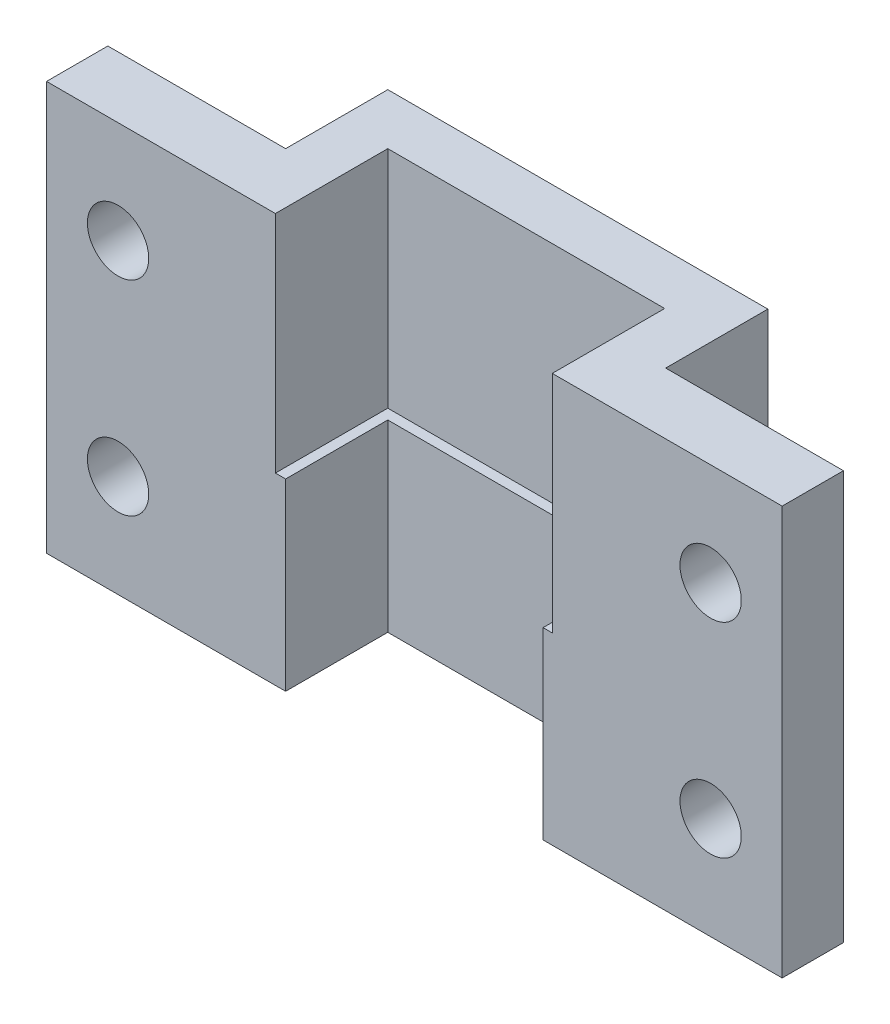
ISO-10303-21;
HEADER;
FILE_DESCRIPTION(('STEP AP214'),'2;1');
FILE_NAME('part.step','',(''),(''),'','','');
FILE_SCHEMA(('AUTOMOTIVE_DESIGN { 1 0 10303 214 1 1 1 1 }'));
ENDSEC;
DATA;
#1=APPLICATION_CONTEXT('core data for automotive mechanical design processes');
#2=APPLICATION_PROTOCOL_DEFINITION('international standard','automotive_design',2000,#1);
#3=PRODUCT_CONTEXT('',#1,'mechanical');
#4=PRODUCT('Part','Part','',(#3));
#5=PRODUCT_RELATED_PRODUCT_CATEGORY('part','',(#4));
#6=PRODUCT_DEFINITION_FORMATION('','',#4);
#7=PRODUCT_DEFINITION_CONTEXT('part definition',#1,'design');
#8=PRODUCT_DEFINITION('design','',#6,#7);
#9=PRODUCT_DEFINITION_SHAPE('','',#8);
#10=(LENGTH_UNIT() NAMED_UNIT(*) SI_UNIT(.MILLI.,.METRE.));
#11=(NAMED_UNIT(*) PLANE_ANGLE_UNIT() SI_UNIT($,.RADIAN.));
#12=(NAMED_UNIT(*) SI_UNIT($,.STERADIAN.) SOLID_ANGLE_UNIT());
#13=UNCERTAINTY_MEASURE_WITH_UNIT(LENGTH_MEASURE(1.E-05),#10,'distance_accuracy_value','');
#14=(GEOMETRIC_REPRESENTATION_CONTEXT(3) GLOBAL_UNCERTAINTY_ASSIGNED_CONTEXT((#13)) GLOBAL_UNIT_ASSIGNED_CONTEXT((#10,
#11,#12)) REPRESENTATION_CONTEXT('',''));
#15=CARTESIAN_POINT('',(0.,0.,0.));
#16=DIRECTION('',(0.,0.,1.));
#17=DIRECTION('',(1.,0.,0.));
#18=AXIS2_PLACEMENT_3D('',#15,#16,#17);
#19=CARTESIAN_POINT('',(28.4704225352113,20.,0.));
#20=DIRECTION('',(-1.,0.,0.));
#21=DIRECTION('',(0.,0.,1.));
#22=AXIS2_PLACEMENT_3D('',#19,#20,#21);
#23=PLANE('',#22);
#24=DIRECTION('',(0.,0.,-1.));
#25=VECTOR('',#24,1.);
#26=CARTESIAN_POINT('',(28.4704225352113,0.,0.));
#27=LINE('',#26,#25);
#28=CARTESIAN_POINT('',(28.4704225352113,0.,3.));
#29=VERTEX_POINT('',#28);
#30=CARTESIAN_POINT('',(28.4704225352113,0.,0.));
#31=VERTEX_POINT('',#30);
#32=EDGE_CURVE('E161',#29,#31,#27,.T.);
#33=ORIENTED_EDGE('',*,*,#32,.T.);
#34=DIRECTION('',(0.,-1.,0.));
#35=VECTOR('',#34,1.);
#36=CARTESIAN_POINT('',(28.4704225352113,20.,0.));
#37=LINE('',#36,#35);
#38=CARTESIAN_POINT('',(28.4704225352113,20.,0.));
#39=VERTEX_POINT('',#38);
#40=EDGE_CURVE('E11',#39,#31,#37,.T.);
#41=ORIENTED_EDGE('',*,*,#40,.F.);
#42=DIRECTION('',(0.,0.,-1.));
#43=VECTOR('',#42,1.);
#44=CARTESIAN_POINT('',(28.4704225352113,20.,0.));
#45=LINE('',#44,#43);
#46=CARTESIAN_POINT('',(28.4704225352113,20.,3.));
#47=VERTEX_POINT('',#46);
#48=EDGE_CURVE('E188',#47,#39,#45,.T.);
#49=ORIENTED_EDGE('',*,*,#48,.F.);
#50=DIRECTION('',(0.,-1.,0.));
#51=VECTOR('',#50,1.);
#52=CARTESIAN_POINT('',(28.4704225352113,20.,3.));
#53=LINE('',#52,#51);
#54=EDGE_CURVE('E160',#47,#29,#53,.T.);
#55=ORIENTED_EDGE('',*,*,#54,.T.);
#56=EDGE_LOOP('',(#33,#41,#49,#55));
#57=FACE_BOUND('',#56,.T.);
#58=ADVANCED_FACE('F34',(#57),#23,.F.);
#59=CARTESIAN_POINT('',(19.7704225352113,20.,0.));
#60=DIRECTION('',(0.,0.,1.));
#61=DIRECTION('',(1.,0.,0.));
#62=AXIS2_PLACEMENT_3D('',#59,#60,#61);
#63=PLANE('',#62);
#64=CARTESIAN_POINT('',(24.9704225352113,15.,0.));
#65=DIRECTION('',(0.,0.,-1.));
#66=DIRECTION('',(-1.,0.,0.));
#67=AXIS2_PLACEMENT_3D('',#64,#65,#66);
#68=CIRCLE('',#67,1.5);
#69=CARTESIAN_POINT('',(23.4704225352113,15.,0.));
#70=VERTEX_POINT('',#69);
#71=EDGE_CURVE('E272',#70,#70,#68,.T.);
#72=ORIENTED_EDGE('',*,*,#71,.F.);
#73=EDGE_LOOP('',(#72));
#74=FACE_BOUND('',#73,.T.);
#75=CARTESIAN_POINT('',(24.9704225352113,5.,0.));
#76=DIRECTION('',(0.,0.,-1.));
#77=DIRECTION('',(-1.,0.,0.));
#78=AXIS2_PLACEMENT_3D('',#75,#76,#77);
#79=CIRCLE('',#78,1.5);
#80=CARTESIAN_POINT('',(23.4704225352113,5.,0.));
#81=VERTEX_POINT('',#80);
#82=EDGE_CURVE('E275',#81,#81,#79,.T.);
#83=ORIENTED_EDGE('',*,*,#82,.F.);
#84=EDGE_LOOP('',(#83));
#85=FACE_BOUND('',#84,.T.);
#86=DIRECTION('',(-1.,0.,0.));
#87=VECTOR('',#86,1.);
#88=CARTESIAN_POINT('',(19.7704225352113,0.,0.));
#89=LINE('',#88,#87);
#90=CARTESIAN_POINT('',(19.7704225352113,0.,0.));
#91=VERTEX_POINT('',#90);
#92=EDGE_CURVE('E164',#31,#91,#89,.T.);
#93=ORIENTED_EDGE('',*,*,#92,.T.);
#94=DIRECTION('',(0.,-1.,0.));
#95=VECTOR('',#94,1.);
#96=CARTESIAN_POINT('',(19.7704225352113,20.,0.));
#97=LINE('',#96,#95);
#98=CARTESIAN_POINT('',(19.7704225352113,20.,0.));
#99=VERTEX_POINT('',#98);
#100=EDGE_CURVE('E42',#99,#91,#97,.T.);
#101=ORIENTED_EDGE('',*,*,#100,.F.);
#102=DIRECTION('',(-1.,0.,0.));
#103=VECTOR('',#102,1.);
#104=CARTESIAN_POINT('',(19.7704225352113,20.,0.));
#105=LINE('',#104,#103);
#106=EDGE_CURVE('E111',#39,#99,#105,.T.);
#107=ORIENTED_EDGE('',*,*,#106,.F.);
#108=ORIENTED_EDGE('',*,*,#40,.T.);
#109=EDGE_LOOP('',(#93,#101,#107,#108));
#110=FACE_BOUND('',#109,.T.);
#111=ADVANCED_FACE('F243',(#74,#85,#110),#63,.F.);
#112=CARTESIAN_POINT('',(19.7704225352113,20.,-5.));
#113=DIRECTION('',(-1.,0.,0.));
#114=DIRECTION('',(0.,0.,1.));
#115=AXIS2_PLACEMENT_3D('',#112,#113,#114);
#116=PLANE('',#115);
#117=DIRECTION('',(0.,0.,-1.));
#118=VECTOR('',#117,1.);
#119=CARTESIAN_POINT('',(19.7704225352113,0.,-5.));
#120=LINE('',#119,#118);
#121=CARTESIAN_POINT('',(19.7704225352113,0.,-5.));
#122=VERTEX_POINT('',#121);
#123=EDGE_CURVE('E166',#91,#122,#120,.T.);
#124=ORIENTED_EDGE('',*,*,#123,.T.);
#125=DIRECTION('',(0.,-1.,0.));
#126=VECTOR('',#125,1.);
#127=CARTESIAN_POINT('',(19.7704225352113,20.,-5.));
#128=LINE('',#127,#126);
#129=CARTESIAN_POINT('',(19.7704225352113,20.,-5.));
#130=VERTEX_POINT('',#129);
#131=EDGE_CURVE('E203',#130,#122,#128,.T.);
#132=ORIENTED_EDGE('',*,*,#131,.F.);
#133=DIRECTION('',(0.,0.,-1.));
#134=VECTOR('',#133,1.);
#135=CARTESIAN_POINT('',(19.7704225352113,20.,-5.));
#136=LINE('',#135,#134);
#137=EDGE_CURVE('E261',#99,#130,#136,.T.);
#138=ORIENTED_EDGE('',*,*,#137,.F.);
#139=ORIENTED_EDGE('',*,*,#100,.T.);
#140=EDGE_LOOP('',(#124,#132,#138,#139));
#141=FACE_BOUND('',#140,.T.);
#142=ADVANCED_FACE('F248',(#141),#116,.F.);
#143=CARTESIAN_POINT('',(1.17042253521126,20.,-5.));
#144=DIRECTION('',(0.,0.,1.));
#145=DIRECTION('',(1.,0.,0.));
#146=AXIS2_PLACEMENT_3D('',#143,#144,#145);
#147=PLANE('',#146);
#148=DIRECTION('',(-1.,0.,0.));
#149=VECTOR('',#148,1.);
#150=CARTESIAN_POINT('',(1.17042253521126,0.,-5.));
#151=LINE('',#150,#149);
#152=CARTESIAN_POINT('',(1.17042253521126,0.,-5.));
#153=VERTEX_POINT('',#152);
#154=EDGE_CURVE('E168',#122,#153,#151,.T.);
#155=ORIENTED_EDGE('',*,*,#154,.T.);
#156=DIRECTION('',(0.,-1.,0.));
#157=VECTOR('',#156,1.);
#158=CARTESIAN_POINT('',(1.17042253521126,20.,-5.));
#159=LINE('',#158,#157);
#160=CARTESIAN_POINT('',(1.17042253521126,20.,-5.));
#161=VERTEX_POINT('',#160);
#162=EDGE_CURVE('E200',#161,#153,#159,.T.);
#163=ORIENTED_EDGE('',*,*,#162,.F.);
#164=DIRECTION('',(-1.,0.,0.));
#165=VECTOR('',#164,1.);
#166=CARTESIAN_POINT('',(1.17042253521126,20.,-5.));
#167=LINE('',#166,#165);
#168=EDGE_CURVE('E263',#130,#161,#167,.T.);
#169=ORIENTED_EDGE('',*,*,#168,.F.);
#170=ORIENTED_EDGE('',*,*,#131,.T.);
#171=EDGE_LOOP('',(#155,#163,#169,#170));
#172=FACE_BOUND('',#171,.T.);
#173=ADVANCED_FACE('F502',(#172),#147,.F.);
#174=CARTESIAN_POINT('',(1.17042253521126,20.,-5.));
#175=DIRECTION('',(1.,0.,0.));
#176=DIRECTION('',(0.,0.,-1.));
#177=AXIS2_PLACEMENT_3D('',#174,#175,#176);
#178=PLANE('',#177);
#179=DIRECTION('',(0.,0.,1.));
#180=VECTOR('',#179,1.);
#181=CARTESIAN_POINT('',(1.17042253521126,0.,-5.));
#182=LINE('',#181,#180);
#183=CARTESIAN_POINT('',(1.17042253521126,0.,0.));
#184=VERTEX_POINT('',#183);
#185=EDGE_CURVE('E170',#153,#184,#182,.T.);
#186=ORIENTED_EDGE('',*,*,#185,.T.);
#187=DIRECTION('',(0.,-1.,0.));
#188=VECTOR('',#187,1.);
#189=CARTESIAN_POINT('',(1.17042253521126,20.,0.));
#190=LINE('',#189,#188);
#191=CARTESIAN_POINT('',(1.17042253521126,20.,0.));
#192=VERTEX_POINT('',#191);
#193=EDGE_CURVE('E148',#192,#184,#190,.T.);
#194=ORIENTED_EDGE('',*,*,#193,.F.);
#195=DIRECTION('',(0.,0.,1.));
#196=VECTOR('',#195,1.);
#197=CARTESIAN_POINT('',(1.17042253521126,20.,-5.));
#198=LINE('',#197,#196);
#199=EDGE_CURVE('E136',#161,#192,#198,.T.);
#200=ORIENTED_EDGE('',*,*,#199,.F.);
#201=ORIENTED_EDGE('',*,*,#162,.T.);
#202=EDGE_LOOP('',(#186,#194,#200,#201));
#203=FACE_BOUND('',#202,.T.);
#204=ADVANCED_FACE('F471',(#203),#178,.F.);
#205=CARTESIAN_POINT('',(1.17042253521126,20.,0.));
#206=DIRECTION('',(0.,0.,1.));
#207=DIRECTION('',(1.,0.,0.));
#208=AXIS2_PLACEMENT_3D('',#205,#206,#207);
#209=PLANE('',#208);
#210=CARTESIAN_POINT('',(-4.02957746478874,5.,0.));
#211=DIRECTION('',(0.,0.,-1.));
#212=DIRECTION('',(-1.,0.,0.));
#213=AXIS2_PLACEMENT_3D('',#210,#211,#212);
#214=CIRCLE('',#213,1.5);
#215=CARTESIAN_POINT('',(-5.52957746478874,5.,0.));
#216=VERTEX_POINT('',#215);
#217=EDGE_CURVE('E271',#216,#216,#214,.T.);
#218=ORIENTED_EDGE('',*,*,#217,.F.);
#219=EDGE_LOOP('',(#218));
#220=FACE_BOUND('',#219,.T.);
#221=CARTESIAN_POINT('',(-4.02957746478874,15.,0.));
#222=DIRECTION('',(0.,0.,-1.));
#223=DIRECTION('',(-1.,0.,0.));
#224=AXIS2_PLACEMENT_3D('',#221,#222,#223);
#225=CIRCLE('',#224,1.5);
#226=CARTESIAN_POINT('',(-5.52957746478874,15.,0.));
#227=VERTEX_POINT('',#226);
#228=EDGE_CURVE('E212',#227,#227,#225,.T.);
#229=ORIENTED_EDGE('',*,*,#228,.F.);
#230=EDGE_LOOP('',(#229));
#231=FACE_BOUND('',#230,.T.);
#232=DIRECTION('',(-1.,0.,0.));
#233=VECTOR('',#232,1.);
#234=CARTESIAN_POINT('',(1.17042253521126,0.,0.));
#235=LINE('',#234,#233);
#236=CARTESIAN_POINT('',(-7.52957746478874,0.,0.));
#237=VERTEX_POINT('',#236);
#238=EDGE_CURVE('E145',#184,#237,#235,.T.);
#239=ORIENTED_EDGE('',*,*,#238,.T.);
#240=DIRECTION('',(0.,-1.,0.));
#241=VECTOR('',#240,1.);
#242=CARTESIAN_POINT('',(-7.52957746478874,20.,0.));
#243=LINE('',#242,#241);
#244=CARTESIAN_POINT('',(-7.52957746478874,20.,0.));
#245=VERTEX_POINT('',#244);
#246=EDGE_CURVE('E142',#245,#237,#243,.T.);
#247=ORIENTED_EDGE('',*,*,#246,.F.);
#248=DIRECTION('',(-1.,0.,0.));
#249=VECTOR('',#248,1.);
#250=CARTESIAN_POINT('',(1.17042253521126,20.,0.));
#251=LINE('',#250,#249);
#252=EDGE_CURVE('E127',#192,#245,#251,.T.);
#253=ORIENTED_EDGE('',*,*,#252,.F.);
#254=ORIENTED_EDGE('',*,*,#193,.T.);
#255=EDGE_LOOP('',(#239,#247,#253,#254));
#256=FACE_BOUND('',#255,.T.);
#257=ADVANCED_FACE('F143',(#220,#231,#256),#209,.F.);
#258=CARTESIAN_POINT('',(-7.52957746478874,20.,0.));
#259=DIRECTION('',(1.,0.,0.));
#260=DIRECTION('',(0.,0.,-1.));
#261=AXIS2_PLACEMENT_3D('',#258,#259,#260);
#262=PLANE('',#261);
#263=DIRECTION('',(0.,0.,1.));
#264=VECTOR('',#263,1.);
#265=CARTESIAN_POINT('',(-7.52957746478874,0.,0.));
#266=LINE('',#265,#264);
#267=CARTESIAN_POINT('',(-7.52957746478874,0.,3.));
#268=VERTEX_POINT('',#267);
#269=EDGE_CURVE('E173',#237,#268,#266,.T.);
#270=ORIENTED_EDGE('',*,*,#269,.T.);
#271=DIRECTION('',(0.,-1.,0.));
#272=VECTOR('',#271,1.);
#273=CARTESIAN_POINT('',(-7.52957746478874,20.,3.));
#274=LINE('',#273,#272);
#275=CARTESIAN_POINT('',(-7.52957746478874,20.,3.));
#276=VERTEX_POINT('',#275);
#277=EDGE_CURVE('E149',#276,#268,#274,.T.);
#278=ORIENTED_EDGE('',*,*,#277,.F.);
#279=DIRECTION('',(0.,0.,1.));
#280=VECTOR('',#279,1.);
#281=CARTESIAN_POINT('',(-7.52957746478874,20.,0.));
#282=LINE('',#281,#280);
#283=EDGE_CURVE('E133',#245,#276,#282,.T.);
#284=ORIENTED_EDGE('',*,*,#283,.F.);
#285=ORIENTED_EDGE('',*,*,#246,.T.);
#286=EDGE_LOOP('',(#270,#278,#284,#285));
#287=FACE_BOUND('',#286,.T.);
#288=ADVANCED_FACE('F151',(#287),#262,.F.);
#289=CARTESIAN_POINT('',(-7.52957746478874,20.,3.));
#290=DIRECTION('',(0.,0.,-1.));
#291=DIRECTION('',(-1.,0.,0.));
#292=AXIS2_PLACEMENT_3D('',#289,#290,#291);
#293=PLANE('',#292);
#294=CARTESIAN_POINT('',(-4.02957746478874,5.,3.));
#295=DIRECTION('',(0.,0.,-1.));
#296=DIRECTION('',(-1.,0.,0.));
#297=AXIS2_PLACEMENT_3D('',#294,#295,#296);
#298=CIRCLE('',#297,1.5);
#299=CARTESIAN_POINT('',(-5.52957746478874,5.,3.));
#300=VERTEX_POINT('',#299);
#301=EDGE_CURVE('E37',#300,#300,#298,.T.);
#302=ORIENTED_EDGE('',*,*,#301,.T.);
#303=EDGE_LOOP('',(#302));
#304=FACE_BOUND('',#303,.T.);
#305=CARTESIAN_POINT('',(-4.02957746478874,15.,3.));
#306=DIRECTION('',(0.,0.,-1.));
#307=DIRECTION('',(-1.,0.,0.));
#308=AXIS2_PLACEMENT_3D('',#305,#306,#307);
#309=CIRCLE('',#308,1.5);
#310=CARTESIAN_POINT('',(-5.52957746478874,15.,3.));
#311=VERTEX_POINT('',#310);
#312=EDGE_CURVE('E214',#311,#311,#309,.T.);
#313=ORIENTED_EDGE('',*,*,#312,.T.);
#314=EDGE_LOOP('',(#313));
#315=FACE_BOUND('',#314,.T.);
#316=DIRECTION('',(1.,0.,0.));
#317=VECTOR('',#316,1.);
#318=CARTESIAN_POINT('',(4.17042253521126,9.,3.));
#319=LINE('',#318,#317);
#320=CARTESIAN_POINT('',(3.67042253521126,9.,3.));
#321=VERTEX_POINT('',#320);
#322=CARTESIAN_POINT('',(4.17042253521126,9.,3.));
#323=VERTEX_POINT('',#322);
#324=EDGE_CURVE('E293',#321,#323,#319,.T.);
#325=ORIENTED_EDGE('',*,*,#324,.F.);
#326=DIRECTION('',(0.,1.,0.));
#327=VECTOR('',#326,1.);
#328=CARTESIAN_POINT('',(3.67042253521126,9.,3.));
#329=LINE('',#328,#327);
#330=CARTESIAN_POINT('',(3.67042253521126,20.,3.));
#331=VERTEX_POINT('',#330);
#332=EDGE_CURVE('E276',#321,#331,#329,.T.);
#333=ORIENTED_EDGE('',*,*,#332,.T.);
#334=DIRECTION('',(1.,0.,0.));
#335=VECTOR('',#334,1.);
#336=CARTESIAN_POINT('',(-7.52957746478874,20.,3.));
#337=LINE('',#336,#335);
#338=EDGE_CURVE('E154',#276,#331,#337,.T.);
#339=ORIENTED_EDGE('',*,*,#338,.F.);
#340=ORIENTED_EDGE('',*,*,#277,.T.);
#341=DIRECTION('',(1.,0.,0.));
#342=VECTOR('',#341,1.);
#343=CARTESIAN_POINT('',(-7.52957746478874,0.,3.));
#344=LINE('',#343,#342);
#345=CARTESIAN_POINT('',(4.17042253521126,0.,3.));
#346=VERTEX_POINT('',#345);
#347=EDGE_CURVE('E175',#268,#346,#344,.T.);
#348=ORIENTED_EDGE('',*,*,#347,.T.);
#349=DIRECTION('',(0.,-1.,0.));
#350=VECTOR('',#349,1.);
#351=CARTESIAN_POINT('',(4.17042253521126,20.,3.));
#352=LINE('',#351,#350);
#353=EDGE_CURVE('E196',#323,#346,#352,.T.);
#354=ORIENTED_EDGE('',*,*,#353,.F.);
#355=EDGE_LOOP('',(#325,#333,#339,#340,#348,#354));
#356=FACE_BOUND('',#355,.T.);
#357=ADVANCED_FACE('F221',(#304,#315,#356),#293,.F.);
#358=CARTESIAN_POINT('',(4.17042253521126,20.,3.));
#359=DIRECTION('',(-1.,0.,0.));
#360=DIRECTION('',(0.,0.,1.));
#361=AXIS2_PLACEMENT_3D('',#358,#359,#360);
#362=PLANE('',#361);
#363=DIRECTION('',(0.,-1.,0.));
#364=VECTOR('',#363,1.);
#365=CARTESIAN_POINT('',(4.17042253521126,20.,-2.));
#366=LINE('',#365,#364);
#367=CARTESIAN_POINT('',(4.17042253521126,9.,-2.));
#368=VERTEX_POINT('',#367);
#369=CARTESIAN_POINT('',(4.17042253521126,0.,-2.));
#370=VERTEX_POINT('',#369);
#371=EDGE_CURVE('E194',#368,#370,#366,.T.);
#372=ORIENTED_EDGE('',*,*,#371,.F.);
#373=DIRECTION('',(0.,0.,-1.));
#374=VECTOR('',#373,1.);
#375=CARTESIAN_POINT('',(4.17042253521126,9.,3.));
#376=LINE('',#375,#374);
#377=EDGE_CURVE('E316',#323,#368,#376,.T.);
#378=ORIENTED_EDGE('',*,*,#377,.F.);
#379=ORIENTED_EDGE('',*,*,#353,.T.);
#380=DIRECTION('',(0.,0.,-1.));
#381=VECTOR('',#380,1.);
#382=CARTESIAN_POINT('',(4.17042253521126,0.,3.));
#383=LINE('',#382,#381);
#384=EDGE_CURVE('E178',#346,#370,#383,.T.);
#385=ORIENTED_EDGE('',*,*,#384,.T.);
#386=EDGE_LOOP('',(#372,#378,#379,#385));
#387=FACE_BOUND('',#386,.T.);
#388=ADVANCED_FACE('F333',(#387),#362,.F.);
#389=CARTESIAN_POINT('',(4.17042253521126,20.,-2.));
#390=DIRECTION('',(0.,0.,-1.));
#391=DIRECTION('',(-1.,0.,0.));
#392=AXIS2_PLACEMENT_3D('',#389,#390,#391);
#393=PLANE('',#392);
#394=DIRECTION('',(0.,-1.,0.));
#395=VECTOR('',#394,1.);
#396=CARTESIAN_POINT('',(16.7704225352113,20.,-2.));
#397=LINE('',#396,#395);
#398=CARTESIAN_POINT('',(16.7704225352113,9.,-2.));
#399=VERTEX_POINT('',#398);
#400=CARTESIAN_POINT('',(16.7704225352113,0.,-2.));
#401=VERTEX_POINT('',#400);
#402=EDGE_CURVE('E192',#399,#401,#397,.T.);
#403=ORIENTED_EDGE('',*,*,#402,.F.);
#404=DIRECTION('',(1.,0.,0.));
#405=VECTOR('',#404,1.);
#406=CARTESIAN_POINT('',(4.17042253521126,9.,-2.));
#407=LINE('',#406,#405);
#408=EDGE_CURVE('E313',#368,#399,#407,.T.);
#409=ORIENTED_EDGE('',*,*,#408,.F.);
#410=ORIENTED_EDGE('',*,*,#371,.T.);
#411=DIRECTION('',(1.,0.,0.));
#412=VECTOR('',#411,1.);
#413=CARTESIAN_POINT('',(4.17042253521126,0.,-2.));
#414=LINE('',#413,#412);
#415=EDGE_CURVE('E181',#370,#401,#414,.T.);
#416=ORIENTED_EDGE('',*,*,#415,.T.);
#417=EDGE_LOOP('',(#403,#409,#410,#416));
#418=FACE_BOUND('',#417,.T.);
#419=ADVANCED_FACE('F339',(#418),#393,.F.);
#420=CARTESIAN_POINT('',(16.7704225352113,20.,3.));
#421=DIRECTION('',(1.,0.,0.));
#422=DIRECTION('',(0.,0.,-1.));
#423=AXIS2_PLACEMENT_3D('',#420,#421,#422);
#424=PLANE('',#423);
#425=DIRECTION('',(0.,-1.,0.));
#426=VECTOR('',#425,1.);
#427=CARTESIAN_POINT('',(16.7704225352113,20.,3.));
#428=LINE('',#427,#426);
#429=CARTESIAN_POINT('',(16.7704225352113,9.,3.));
#430=VERTEX_POINT('',#429);
#431=CARTESIAN_POINT('',(16.7704225352113,0.,3.));
#432=VERTEX_POINT('',#431);
#433=EDGE_CURVE('E190',#430,#432,#428,.T.);
#434=ORIENTED_EDGE('',*,*,#433,.F.);
#435=DIRECTION('',(0.,0.,1.));
#436=VECTOR('',#435,1.);
#437=CARTESIAN_POINT('',(16.7704225352113,9.,-2.));
#438=LINE('',#437,#436);
#439=EDGE_CURVE('E310',#399,#430,#438,.T.);
#440=ORIENTED_EDGE('',*,*,#439,.F.);
#441=ORIENTED_EDGE('',*,*,#402,.T.);
#442=DIRECTION('',(0.,0.,1.));
#443=VECTOR('',#442,1.);
#444=CARTESIAN_POINT('',(16.7704225352113,0.,3.));
#445=LINE('',#444,#443);
#446=EDGE_CURVE('E184',#401,#432,#445,.T.);
#447=ORIENTED_EDGE('',*,*,#446,.T.);
#448=EDGE_LOOP('',(#434,#440,#441,#447));
#449=FACE_BOUND('',#448,.T.);
#450=ADVANCED_FACE('F348',(#449),#424,.F.);
#451=CARTESIAN_POINT('',(16.7704225352113,20.,3.));
#452=DIRECTION('',(0.,0.,-1.));
#453=DIRECTION('',(-1.,0.,0.));
#454=AXIS2_PLACEMENT_3D('',#451,#452,#453);
#455=PLANE('',#454);
#456=CARTESIAN_POINT('',(24.9704225352113,15.,3.));
#457=DIRECTION('',(0.,0.,-1.));
#458=DIRECTION('',(-1.,0.,0.));
#459=AXIS2_PLACEMENT_3D('',#456,#457,#458);
#460=CIRCLE('',#459,1.5);
#461=CARTESIAN_POINT('',(23.4704225352113,15.,3.));
#462=VERTEX_POINT('',#461);
#463=EDGE_CURVE('E211',#462,#462,#460,.T.);
#464=ORIENTED_EDGE('',*,*,#463,.T.);
#465=EDGE_LOOP('',(#464));
#466=FACE_BOUND('',#465,.T.);
#467=CARTESIAN_POINT('',(24.9704225352113,5.,3.));
#468=DIRECTION('',(0.,0.,-1.));
#469=DIRECTION('',(-1.,0.,0.));
#470=AXIS2_PLACEMENT_3D('',#467,#468,#469);
#471=CIRCLE('',#470,1.5);
#472=CARTESIAN_POINT('',(23.4704225352113,5.,3.));
#473=VERTEX_POINT('',#472);
#474=EDGE_CURVE('E208',#473,#473,#471,.T.);
#475=ORIENTED_EDGE('',*,*,#474,.T.);
#476=EDGE_LOOP('',(#475));
#477=FACE_BOUND('',#476,.T.);
#478=DIRECTION('',(1.,0.,0.));
#479=VECTOR('',#478,1.);
#480=CARTESIAN_POINT('',(16.7704225352113,20.,3.));
#481=LINE('',#480,#479);
#482=CARTESIAN_POINT('',(17.2204225352113,20.,3.));
#483=VERTEX_POINT('',#482);
#484=EDGE_CURVE('E58',#483,#47,#481,.T.);
#485=ORIENTED_EDGE('',*,*,#484,.F.);
#486=DIRECTION('',(0.,1.,0.));
#487=VECTOR('',#486,1.);
#488=CARTESIAN_POINT('',(17.2204225352113,9.,3.));
#489=LINE('',#488,#487);
#490=CARTESIAN_POINT('',(17.2204225352113,9.,3.));
#491=VERTEX_POINT('',#490);
#492=EDGE_CURVE('E50',#491,#483,#489,.T.);
#493=ORIENTED_EDGE('',*,*,#492,.F.);
#494=DIRECTION('',(1.,0.,0.));
#495=VECTOR('',#494,1.);
#496=CARTESIAN_POINT('',(17.2204225352113,9.,3.));
#497=LINE('',#496,#495);
#498=EDGE_CURVE('E307',#430,#491,#497,.T.);
#499=ORIENTED_EDGE('',*,*,#498,.F.);
#500=ORIENTED_EDGE('',*,*,#433,.T.);
#501=DIRECTION('',(1.,0.,0.));
#502=VECTOR('',#501,1.);
#503=CARTESIAN_POINT('',(16.7704225352113,0.,3.));
#504=LINE('',#503,#502);
#505=EDGE_CURVE('E103',#432,#29,#504,.T.);
#506=ORIENTED_EDGE('',*,*,#505,.T.);
#507=ORIENTED_EDGE('',*,*,#54,.F.);
#508=EDGE_LOOP('',(#485,#493,#499,#500,#506,#507));
#509=FACE_BOUND('',#508,.T.);
#510=ADVANCED_FACE('F351',(#466,#477,#509),#455,.F.);
#511=CARTESIAN_POINT('',(0.,20.,0.));
#512=DIRECTION('',(0.,1.,0.));
#513=DIRECTION('',(0.,0.,1.));
#514=AXIS2_PLACEMENT_3D('',#511,#512,#513);
#515=PLANE('',#514);
#516=DIRECTION('',(0.,0.,1.));
#517=VECTOR('',#516,1.);
#518=CARTESIAN_POINT('',(3.67042253521126,20.,3.));
#519=LINE('',#518,#517);
#520=CARTESIAN_POINT('',(3.67042253521126,20.,-2.5));
#521=VERTEX_POINT('',#520);
#522=EDGE_CURVE('E290',#521,#331,#519,.T.);
#523=ORIENTED_EDGE('',*,*,#522,.F.);
#524=DIRECTION('',(-1.,0.,0.));
#525=VECTOR('',#524,1.);
#526=CARTESIAN_POINT('',(3.67042253521126,20.,-2.5));
#527=LINE('',#526,#525);
#528=CARTESIAN_POINT('',(17.2204225352113,20.,-2.5));
#529=VERTEX_POINT('',#528);
#530=EDGE_CURVE('E294',#529,#521,#527,.T.);
#531=ORIENTED_EDGE('',*,*,#530,.F.);
#532=DIRECTION('',(0.,0.,-1.));
#533=VECTOR('',#532,1.);
#534=CARTESIAN_POINT('',(17.2204225352113,20.,3.));
#535=LINE('',#534,#533);
#536=EDGE_CURVE('E297',#483,#529,#535,.T.);
#537=ORIENTED_EDGE('',*,*,#536,.F.);
#538=ORIENTED_EDGE('',*,*,#484,.T.);
#539=ORIENTED_EDGE('',*,*,#48,.T.);
#540=ORIENTED_EDGE('',*,*,#106,.T.);
#541=ORIENTED_EDGE('',*,*,#137,.T.);
#542=ORIENTED_EDGE('',*,*,#168,.T.);
#543=ORIENTED_EDGE('',*,*,#199,.T.);
#544=ORIENTED_EDGE('',*,*,#252,.T.);
#545=ORIENTED_EDGE('',*,*,#283,.T.);
#546=ORIENTED_EDGE('',*,*,#338,.T.);
#547=EDGE_LOOP('',(#523,#531,#537,#538,#539,#540,#541,#542,#543,#544,#545,#546));
#548=FACE_BOUND('',#547,.T.);
#549=ADVANCED_FACE('F130',(#548),#515,.T.);
#550=CARTESIAN_POINT('',(0.,0.,0.));
#551=DIRECTION('',(0.,1.,0.));
#552=DIRECTION('',(0.,0.,1.));
#553=AXIS2_PLACEMENT_3D('',#550,#551,#552);
#554=PLANE('',#553);
#555=ORIENTED_EDGE('',*,*,#32,.F.);
#556=ORIENTED_EDGE('',*,*,#505,.F.);
#557=ORIENTED_EDGE('',*,*,#446,.F.);
#558=ORIENTED_EDGE('',*,*,#415,.F.);
#559=ORIENTED_EDGE('',*,*,#384,.F.);
#560=ORIENTED_EDGE('',*,*,#347,.F.);
#561=ORIENTED_EDGE('',*,*,#269,.F.);
#562=ORIENTED_EDGE('',*,*,#238,.F.);
#563=ORIENTED_EDGE('',*,*,#185,.F.);
#564=ORIENTED_EDGE('',*,*,#154,.F.);
#565=ORIENTED_EDGE('',*,*,#123,.F.);
#566=ORIENTED_EDGE('',*,*,#92,.F.);
#567=EDGE_LOOP('',(#555,#556,#557,#558,#559,#560,#561,#562,#563,#564,#565,#566));
#568=FACE_BOUND('',#567,.T.);
#569=ADVANCED_FACE('F254',(#568),#554,.F.);
#570=CARTESIAN_POINT('',(24.9704225352113,5.,16.));
#571=DIRECTION('',(0.,0.,-1.));
#572=DIRECTION('',(-1.,0.,0.));
#573=AXIS2_PLACEMENT_3D('',#570,#571,#572);
#574=CYLINDRICAL_SURFACE('',#573,1.5);
#575=ORIENTED_EDGE('',*,*,#82,.T.);
#576=EDGE_LOOP('',(#575));
#577=FACE_BOUND('',#576,.T.);
#578=ORIENTED_EDGE('',*,*,#474,.F.);
#579=EDGE_LOOP('',(#578));
#580=FACE_BOUND('',#579,.T.);
#581=ADVANCED_FACE('F453',(#577,#580),#574,.F.);
#582=CARTESIAN_POINT('',(24.9704225352113,15.,16.));
#583=DIRECTION('',(0.,0.,-1.));
#584=DIRECTION('',(-1.,0.,0.));
#585=AXIS2_PLACEMENT_3D('',#582,#583,#584);
#586=CYLINDRICAL_SURFACE('',#585,1.5);
#587=ORIENTED_EDGE('',*,*,#71,.T.);
#588=EDGE_LOOP('',(#587));
#589=FACE_BOUND('',#588,.T.);
#590=ORIENTED_EDGE('',*,*,#463,.F.);
#591=EDGE_LOOP('',(#590));
#592=FACE_BOUND('',#591,.T.);
#593=ADVANCED_FACE('F236',(#589,#592),#586,.F.);
#594=CARTESIAN_POINT('',(-4.02957746478874,15.,16.));
#595=DIRECTION('',(0.,0.,-1.));
#596=DIRECTION('',(-1.,0.,0.));
#597=AXIS2_PLACEMENT_3D('',#594,#595,#596);
#598=CYLINDRICAL_SURFACE('',#597,1.5);
#599=ORIENTED_EDGE('',*,*,#228,.T.);
#600=EDGE_LOOP('',(#599));
#601=FACE_BOUND('',#600,.T.);
#602=ORIENTED_EDGE('',*,*,#312,.F.);
#603=EDGE_LOOP('',(#602));
#604=FACE_BOUND('',#603,.T.);
#605=ADVANCED_FACE('F226',(#601,#604),#598,.F.);
#606=CARTESIAN_POINT('',(-4.02957746478874,5.,16.));
#607=DIRECTION('',(0.,0.,-1.));
#608=DIRECTION('',(-1.,0.,0.));
#609=AXIS2_PLACEMENT_3D('',#606,#607,#608);
#610=CYLINDRICAL_SURFACE('',#609,1.5);
#611=ORIENTED_EDGE('',*,*,#217,.T.);
#612=EDGE_LOOP('',(#611));
#613=FACE_BOUND('',#612,.T.);
#614=ORIENTED_EDGE('',*,*,#301,.F.);
#615=EDGE_LOOP('',(#614));
#616=FACE_BOUND('',#615,.T.);
#617=ADVANCED_FACE('F223',(#613,#616),#610,.F.);
#618=CARTESIAN_POINT('',(3.67042253521126,9.,3.));
#619=DIRECTION('',(-1.,0.,0.));
#620=DIRECTION('',(0.,0.,1.));
#621=AXIS2_PLACEMENT_3D('',#618,#619,#620);
#622=PLANE('',#621);
#623=ORIENTED_EDGE('',*,*,#522,.T.);
#624=ORIENTED_EDGE('',*,*,#332,.F.);
#625=DIRECTION('',(0.,0.,1.));
#626=VECTOR('',#625,1.);
#627=CARTESIAN_POINT('',(3.67042253521126,9.,3.));
#628=LINE('',#627,#626);
#629=CARTESIAN_POINT('',(3.67042253521126,9.,-2.5));
#630=VERTEX_POINT('',#629);
#631=EDGE_CURVE('E282',#630,#321,#628,.T.);
#632=ORIENTED_EDGE('',*,*,#631,.F.);
#633=DIRECTION('',(0.,1.,0.));
#634=VECTOR('',#633,1.);
#635=CARTESIAN_POINT('',(3.67042253521126,9.,-2.5));
#636=LINE('',#635,#634);
#637=EDGE_CURVE('E285',#630,#521,#636,.T.);
#638=ORIENTED_EDGE('',*,*,#637,.T.);
#639=EDGE_LOOP('',(#623,#624,#632,#638));
#640=FACE_BOUND('',#639,.T.);
#641=ADVANCED_FACE('F225',(#640),#622,.F.);
#642=CARTESIAN_POINT('',(3.67042253521126,9.,-2.5));
#643=DIRECTION('',(0.,0.,-1.));
#644=DIRECTION('',(-1.,0.,0.));
#645=AXIS2_PLACEMENT_3D('',#642,#643,#644);
#646=PLANE('',#645);
#647=ORIENTED_EDGE('',*,*,#530,.T.);
#648=ORIENTED_EDGE('',*,*,#637,.F.);
#649=DIRECTION('',(-1.,0.,0.));
#650=VECTOR('',#649,1.);
#651=CARTESIAN_POINT('',(3.67042253521126,9.,-2.5));
#652=LINE('',#651,#650);
#653=CARTESIAN_POINT('',(17.2204225352113,9.,-2.5));
#654=VERTEX_POINT('',#653);
#655=EDGE_CURVE('E301',#654,#630,#652,.T.);
#656=ORIENTED_EDGE('',*,*,#655,.F.);
#657=DIRECTION('',(0.,1.,0.));
#658=VECTOR('',#657,1.);
#659=CARTESIAN_POINT('',(17.2204225352113,9.,-2.5));
#660=LINE('',#659,#658);
#661=EDGE_CURVE('E281',#654,#529,#660,.T.);
#662=ORIENTED_EDGE('',*,*,#661,.T.);
#663=EDGE_LOOP('',(#647,#648,#656,#662));
#664=FACE_BOUND('',#663,.T.);
#665=ADVANCED_FACE('F233',(#664),#646,.F.);
#666=CARTESIAN_POINT('',(17.2204225352113,9.,3.));
#667=DIRECTION('',(1.,0.,0.));
#668=DIRECTION('',(0.,0.,-1.));
#669=AXIS2_PLACEMENT_3D('',#666,#667,#668);
#670=PLANE('',#669);
#671=ORIENTED_EDGE('',*,*,#536,.T.);
#672=ORIENTED_EDGE('',*,*,#661,.F.);
#673=DIRECTION('',(0.,0.,-1.));
#674=VECTOR('',#673,1.);
#675=CARTESIAN_POINT('',(17.2204225352113,9.,3.));
#676=LINE('',#675,#674);
#677=EDGE_CURVE('E304',#491,#654,#676,.T.);
#678=ORIENTED_EDGE('',*,*,#677,.F.);
#679=ORIENTED_EDGE('',*,*,#492,.T.);
#680=EDGE_LOOP('',(#671,#672,#678,#679));
#681=FACE_BOUND('',#680,.T.);
#682=ADVANCED_FACE('F367',(#681),#670,.F.);
#683=CARTESIAN_POINT('',(0.,9.,0.));
#684=DIRECTION('',(0.,-1.,0.));
#685=DIRECTION('',(0.,0.,-1.));
#686=AXIS2_PLACEMENT_3D('',#683,#684,#685);
#687=PLANE('',#686);
#688=ORIENTED_EDGE('',*,*,#324,.T.);
#689=ORIENTED_EDGE('',*,*,#377,.T.);
#690=ORIENTED_EDGE('',*,*,#408,.T.);
#691=ORIENTED_EDGE('',*,*,#439,.T.);
#692=ORIENTED_EDGE('',*,*,#498,.T.);
#693=ORIENTED_EDGE('',*,*,#677,.T.);
#694=ORIENTED_EDGE('',*,*,#655,.T.);
#695=ORIENTED_EDGE('',*,*,#631,.T.);
#696=EDGE_LOOP('',(#688,#689,#690,#691,#692,#693,#694,#695));
#697=FACE_BOUND('',#696,.T.);
#698=ADVANCED_FACE('F324',(#697),#687,.F.);
#699=CLOSED_SHELL('',(#58,#111,#142,#173,#204,#257,#288,#357,#388,#419,#450,#510,#549,#569,#581,
#593,#605,#617,#641,#665,#682,#698));
#700=MANIFOLD_SOLID_BREP('B2',#699);
#701=ADVANCED_BREP_SHAPE_REPRESENTATION('',(#18,#700),#14);
#702=SHAPE_DEFINITION_REPRESENTATION(#9,#701);
ENDSEC;
END-ISO-10303-21;
